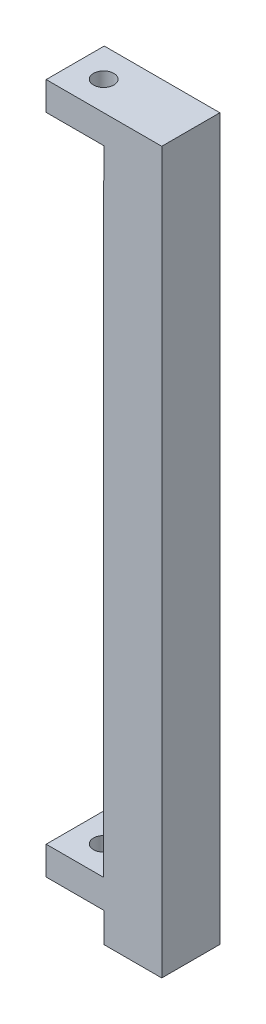
ISO-10303-21;
HEADER;
FILE_DESCRIPTION(('STEP AP214'),'2;1');
FILE_NAME('part.step','',(''),(''),'','','');
FILE_SCHEMA(('AUTOMOTIVE_DESIGN { 1 0 10303 214 1 1 1 1 }'));
ENDSEC;
DATA;
#1=APPLICATION_CONTEXT('core data for automotive mechanical design processes');
#2=APPLICATION_PROTOCOL_DEFINITION('international standard','automotive_design',2000,#1);
#3=PRODUCT_CONTEXT('',#1,'mechanical');
#4=PRODUCT('Part','Part','',(#3));
#5=PRODUCT_RELATED_PRODUCT_CATEGORY('part','',(#4));
#6=PRODUCT_DEFINITION_FORMATION('','',#4);
#7=PRODUCT_DEFINITION_CONTEXT('part definition',#1,'design');
#8=PRODUCT_DEFINITION('design','',#6,#7);
#9=PRODUCT_DEFINITION_SHAPE('','',#8);
#10=(LENGTH_UNIT() NAMED_UNIT(*) SI_UNIT(.MILLI.,.METRE.));
#11=(NAMED_UNIT(*) PLANE_ANGLE_UNIT() SI_UNIT($,.RADIAN.));
#12=(NAMED_UNIT(*) SI_UNIT($,.STERADIAN.) SOLID_ANGLE_UNIT());
#13=UNCERTAINTY_MEASURE_WITH_UNIT(LENGTH_MEASURE(1.E-05),#10,'distance_accuracy_value','');
#14=(GEOMETRIC_REPRESENTATION_CONTEXT(3) GLOBAL_UNCERTAINTY_ASSIGNED_CONTEXT((#13)) GLOBAL_UNIT_ASSIGNED_CONTEXT((#10,
#11,#12)) REPRESENTATION_CONTEXT('',''));
#15=CARTESIAN_POINT('',(0.,0.,0.));
#16=DIRECTION('',(0.,0.,1.));
#17=DIRECTION('',(1.,0.,0.));
#18=AXIS2_PLACEMENT_3D('',#15,#16,#17);
#19=CARTESIAN_POINT('',(10.,0.,-10.));
#20=DIRECTION('',(0.,-1.,0.));
#21=DIRECTION('',(0.,0.,-1.));
#22=AXIS2_PLACEMENT_3D('',#19,#20,#21);
#23=PLANE('',#22);
#24=DIRECTION('',(0.,0.,1.));
#25=VECTOR('',#24,1.);
#26=CARTESIAN_POINT('',(0.1,0.,-10.));
#27=LINE('',#26,#25);
#28=CARTESIAN_POINT('',(0.1,0.,-10.));
#29=VERTEX_POINT('',#28);
#30=CARTESIAN_POINT('',(0.0999999999999994,0.,0.));
#31=VERTEX_POINT('',#30);
#32=EDGE_CURVE('E64',#29,#31,#27,.T.);
#33=ORIENTED_EDGE('',*,*,#32,.F.);
#34=DIRECTION('',(1.,0.,0.));
#35=VECTOR('',#34,1.);
#36=CARTESIAN_POINT('',(10.,0.,-10.));
#37=LINE('',#36,#35);
#38=CARTESIAN_POINT('',(10.,0.,-10.));
#39=VERTEX_POINT('',#38);
#40=EDGE_CURVE('E144',#29,#39,#37,.T.);
#41=ORIENTED_EDGE('',*,*,#40,.T.);
#42=DIRECTION('',(0.,0.,1.));
#43=VECTOR('',#42,1.);
#44=CARTESIAN_POINT('',(10.,0.,-10.));
#45=LINE('',#44,#43);
#46=CARTESIAN_POINT('',(10.,0.,0.));
#47=VERTEX_POINT('',#46);
#48=EDGE_CURVE('E42',#39,#47,#45,.T.);
#49=ORIENTED_EDGE('',*,*,#48,.T.);
#50=DIRECTION('',(1.,0.,0.));
#51=VECTOR('',#50,1.);
#52=CARTESIAN_POINT('',(10.,0.,0.));
#53=LINE('',#52,#51);
#54=EDGE_CURVE('E146',#31,#47,#53,.T.);
#55=ORIENTED_EDGE('',*,*,#54,.F.);
#56=EDGE_LOOP('',(#33,#41,#49,#55));
#57=FACE_BOUND('',#56,.T.);
#58=ADVANCED_FACE('F39',(#57),#23,.T.);
#59=CARTESIAN_POINT('',(-10.,10.,-10.));
#60=DIRECTION('',(0.,1.,0.));
#61=DIRECTION('',(0.,0.,1.));
#62=AXIS2_PLACEMENT_3D('',#59,#60,#61);
#63=PLANE('',#62);
#64=CARTESIAN_POINT('',(-5.,9.99999999999999,-5.));
#65=DIRECTION('',(0.,1.,0.));
#66=DIRECTION('',(0.,0.,1.));
#67=AXIS2_PLACEMENT_3D('',#64,#65,#66);
#68=CIRCLE('',#67,1.75);
#69=CARTESIAN_POINT('',(-5.,9.99999999999999,-3.25));
#70=VERTEX_POINT('',#69);
#71=EDGE_CURVE('E248',#70,#70,#68,.T.);
#72=ORIENTED_EDGE('',*,*,#71,.F.);
#73=EDGE_LOOP('',(#72));
#74=FACE_BOUND('',#73,.T.);
#75=DIRECTION('',(0.,0.,1.));
#76=VECTOR('',#75,1.);
#77=CARTESIAN_POINT('',(-9.9,10.,-10.));
#78=LINE('',#77,#76);
#79=CARTESIAN_POINT('',(-9.9,10.,-10.));
#80=VERTEX_POINT('',#79);
#81=CARTESIAN_POINT('',(-9.9,10.,0.));
#82=VERTEX_POINT('',#81);
#83=EDGE_CURVE('E182',#80,#82,#78,.T.);
#84=ORIENTED_EDGE('',*,*,#83,.T.);
#85=DIRECTION('',(-1.,0.,0.));
#86=VECTOR('',#85,1.);
#87=CARTESIAN_POINT('',(-10.,10.,0.));
#88=LINE('',#87,#86);
#89=CARTESIAN_POINT('',(0.,10.,0.));
#90=VERTEX_POINT('',#89);
#91=EDGE_CURVE('E157',#90,#82,#88,.T.);
#92=ORIENTED_EDGE('',*,*,#91,.F.);
#93=DIRECTION('',(0.,0.,1.));
#94=VECTOR('',#93,1.);
#95=CARTESIAN_POINT('',(0.,10.,-10.));
#96=LINE('',#95,#94);
#97=CARTESIAN_POINT('',(0.,10.,-10.));
#98=VERTEX_POINT('',#97);
#99=EDGE_CURVE('E11',#98,#90,#96,.T.);
#100=ORIENTED_EDGE('',*,*,#99,.F.);
#101=DIRECTION('',(-1.,0.,0.));
#102=VECTOR('',#101,1.);
#103=CARTESIAN_POINT('',(-10.,10.,-10.));
#104=LINE('',#103,#102);
#105=EDGE_CURVE('E175',#98,#80,#104,.T.);
#106=ORIENTED_EDGE('',*,*,#105,.T.);
#107=EDGE_LOOP('',(#84,#92,#100,#106));
#108=FACE_BOUND('',#107,.T.);
#109=ADVANCED_FACE('F292',(#74,#108),#63,.T.);
#110=CARTESIAN_POINT('',(0.,10.,-10.));
#111=DIRECTION('',(-1.,0.,0.));
#112=DIRECTION('',(0.,0.,1.));
#113=AXIS2_PLACEMENT_3D('',#110,#111,#112);
#114=PLANE('',#113);
#115=DIRECTION('',(0.,0.,1.));
#116=VECTOR('',#115,1.);
#117=CARTESIAN_POINT('',(0.,113.9,-10.));
#118=LINE('',#117,#116);
#119=CARTESIAN_POINT('',(0.,113.9,-10.));
#120=VERTEX_POINT('',#119);
#121=CARTESIAN_POINT('',(0.,113.9,0.));
#122=VERTEX_POINT('',#121);
#123=EDGE_CURVE('E56',#120,#122,#118,.T.);
#124=ORIENTED_EDGE('',*,*,#123,.F.);
#125=DIRECTION('',(0.,-1.,0.));
#126=VECTOR('',#125,1.);
#127=CARTESIAN_POINT('',(0.,10.,-10.));
#128=LINE('',#127,#126);
#129=EDGE_CURVE('E172',#120,#98,#128,.T.);
#130=ORIENTED_EDGE('',*,*,#129,.T.);
#131=ORIENTED_EDGE('',*,*,#99,.T.);
#132=DIRECTION('',(0.,-1.,0.));
#133=VECTOR('',#132,1.);
#134=CARTESIAN_POINT('',(0.,10.,0.));
#135=LINE('',#134,#133);
#136=EDGE_CURVE('E164',#122,#90,#135,.T.);
#137=ORIENTED_EDGE('',*,*,#136,.F.);
#138=EDGE_LOOP('',(#124,#130,#131,#137));
#139=FACE_BOUND('',#138,.T.);
#140=ADVANCED_FACE('F296',(#139),#114,.T.);
#141=CARTESIAN_POINT('',(-10.,124.,-10.));
#142=DIRECTION('',(0.,1.,0.));
#143=DIRECTION('',(0.,0.,1.));
#144=AXIS2_PLACEMENT_3D('',#141,#142,#143);
#145=PLANE('',#144);
#146=CARTESIAN_POINT('',(-5.,124.,-5.));
#147=DIRECTION('',(0.,-1.,0.));
#148=DIRECTION('',(0.,0.,-1.));
#149=AXIS2_PLACEMENT_3D('',#146,#147,#148);
#150=CIRCLE('',#149,1.75);
#151=CARTESIAN_POINT('',(-5.,124.,-6.75));
#152=VERTEX_POINT('',#151);
#153=EDGE_CURVE('E274',#152,#152,#150,.T.);
#154=ORIENTED_EDGE('',*,*,#153,.T.);
#155=EDGE_LOOP('',(#154));
#156=FACE_BOUND('',#155,.T.);
#157=DIRECTION('',(0.,0.,1.));
#158=VECTOR('',#157,1.);
#159=CARTESIAN_POINT('',(-9.90000000000001,124.,-10.));
#160=LINE('',#159,#158);
#161=CARTESIAN_POINT('',(-9.90000000000001,124.,-10.));
#162=VERTEX_POINT('',#161);
#163=CARTESIAN_POINT('',(-9.90000000000001,124.,0.));
#164=VERTEX_POINT('',#163);
#165=EDGE_CURVE('E206',#162,#164,#160,.T.);
#166=ORIENTED_EDGE('',*,*,#165,.T.);
#167=DIRECTION('',(-1.,0.,0.));
#168=VECTOR('',#167,1.);
#169=CARTESIAN_POINT('',(-10.,124.,0.));
#170=LINE('',#169,#168);
#171=CARTESIAN_POINT('',(9.99999999999999,124.,0.));
#172=VERTEX_POINT('',#171);
#173=EDGE_CURVE('E186',#172,#164,#170,.T.);
#174=ORIENTED_EDGE('',*,*,#173,.F.);
#175=DIRECTION('',(0.,0.,1.));
#176=VECTOR('',#175,1.);
#177=CARTESIAN_POINT('',(9.99999999999999,124.,-10.));
#178=LINE('',#177,#176);
#179=CARTESIAN_POINT('',(9.99999999999999,124.,-10.));
#180=VERTEX_POINT('',#179);
#181=EDGE_CURVE('E48',#180,#172,#178,.T.);
#182=ORIENTED_EDGE('',*,*,#181,.F.);
#183=DIRECTION('',(-1.,0.,0.));
#184=VECTOR('',#183,1.);
#185=CARTESIAN_POINT('',(-10.,124.,-10.));
#186=LINE('',#185,#184);
#187=EDGE_CURVE('E161',#180,#162,#186,.T.);
#188=ORIENTED_EDGE('',*,*,#187,.T.);
#189=EDGE_LOOP('',(#166,#174,#182,#188));
#190=FACE_BOUND('',#189,.T.);
#191=ADVANCED_FACE('F307',(#156,#190),#145,.T.);
#192=CARTESIAN_POINT('',(9.99999999999999,124.,-10.));
#193=DIRECTION('',(1.,0.,0.));
#194=DIRECTION('',(0.,1.,0.));
#195=AXIS2_PLACEMENT_3D('',#192,#193,#194);
#196=PLANE('',#195);
#197=DIRECTION('',(0.,1.,0.));
#198=VECTOR('',#197,1.);
#199=CARTESIAN_POINT('',(9.99999999999999,124.,0.));
#200=LINE('',#199,#198);
#201=EDGE_CURVE('E181',#47,#172,#200,.T.);
#202=ORIENTED_EDGE('',*,*,#201,.F.);
#203=ORIENTED_EDGE('',*,*,#48,.F.);
#204=DIRECTION('',(0.,1.,0.));
#205=VECTOR('',#204,1.);
#206=CARTESIAN_POINT('',(9.99999999999999,124.,-10.));
#207=LINE('',#206,#205);
#208=EDGE_CURVE('E155',#39,#180,#207,.T.);
#209=ORIENTED_EDGE('',*,*,#208,.T.);
#210=ORIENTED_EDGE('',*,*,#181,.T.);
#211=EDGE_LOOP('',(#202,#203,#209,#210));
#212=FACE_BOUND('',#211,.T.);
#213=ADVANCED_FACE('F196',(#212),#196,.T.);
#214=CARTESIAN_POINT('',(0.,0.,-10.));
#215=DIRECTION('',(0.,0.,-1.));
#216=DIRECTION('',(-1.,0.,0.));
#217=AXIS2_PLACEMENT_3D('',#214,#215,#216);
#218=PLANE('',#217);
#219=DIRECTION('',(0.,1.,0.));
#220=VECTOR('',#219,1.);
#221=CARTESIAN_POINT('',(-9.9,10.,-10.));
#222=LINE('',#221,#220);
#223=CARTESIAN_POINT('',(-9.9,5.1,-10.));
#224=VERTEX_POINT('',#223);
#225=EDGE_CURVE('E148',#224,#80,#222,.T.);
#226=ORIENTED_EDGE('',*,*,#225,.T.);
#227=ORIENTED_EDGE('',*,*,#105,.F.);
#228=ORIENTED_EDGE('',*,*,#129,.F.);
#229=DIRECTION('',(1.,0.,0.));
#230=VECTOR('',#229,1.);
#231=CARTESIAN_POINT('',(0.,113.9,-10.));
#232=LINE('',#231,#230);
#233=CARTESIAN_POINT('',(0.1,113.9,-10.));
#234=VERTEX_POINT('',#233);
#235=EDGE_CURVE('E227',#120,#234,#232,.T.);
#236=ORIENTED_EDGE('',*,*,#235,.T.);
#237=DIRECTION('',(0.,1.,0.));
#238=VECTOR('',#237,1.);
#239=CARTESIAN_POINT('',(0.0999999999999994,119.1,-10.));
#240=LINE('',#239,#238);
#241=CARTESIAN_POINT('',(0.0999999999999994,119.1,-10.));
#242=VERTEX_POINT('',#241);
#243=EDGE_CURVE('E231',#234,#242,#240,.T.);
#244=ORIENTED_EDGE('',*,*,#243,.T.);
#245=DIRECTION('',(-1.,0.,0.));
#246=VECTOR('',#245,1.);
#247=CARTESIAN_POINT('',(-9.90000000000001,119.1,-10.));
#248=LINE('',#247,#246);
#249=CARTESIAN_POINT('',(-9.90000000000001,119.1,-10.));
#250=VERTEX_POINT('',#249);
#251=EDGE_CURVE('E236',#242,#250,#248,.T.);
#252=ORIENTED_EDGE('',*,*,#251,.T.);
#253=DIRECTION('',(0.,1.,0.));
#254=VECTOR('',#253,1.);
#255=CARTESIAN_POINT('',(-9.90000000000001,124.,-10.));
#256=LINE('',#255,#254);
#257=EDGE_CURVE('E240',#250,#162,#256,.T.);
#258=ORIENTED_EDGE('',*,*,#257,.T.);
#259=ORIENTED_EDGE('',*,*,#187,.F.);
#260=ORIENTED_EDGE('',*,*,#208,.F.);
#261=ORIENTED_EDGE('',*,*,#40,.F.);
#262=DIRECTION('',(0.,1.,0.));
#263=VECTOR('',#262,1.);
#264=CARTESIAN_POINT('',(0.1,5.1,-10.));
#265=LINE('',#264,#263);
#266=CARTESIAN_POINT('',(0.1,5.1,-10.));
#267=VERTEX_POINT('',#266);
#268=EDGE_CURVE('E130',#29,#267,#265,.T.);
#269=ORIENTED_EDGE('',*,*,#268,.T.);
#270=DIRECTION('',(-1.,0.,0.));
#271=VECTOR('',#270,1.);
#272=CARTESIAN_POINT('',(-9.9,5.1,-10.));
#273=LINE('',#272,#271);
#274=EDGE_CURVE('E138',#267,#224,#273,.T.);
#275=ORIENTED_EDGE('',*,*,#274,.T.);
#276=EDGE_LOOP('',(#226,#227,#228,#236,#244,#252,#258,#259,#260,#261,#269,#275));
#277=FACE_BOUND('',#276,.T.);
#278=ADVANCED_FACE('F152',(#277),#218,.T.);
#279=CARTESIAN_POINT('',(0.,0.,0.));
#280=DIRECTION('',(0.,0.,-1.));
#281=DIRECTION('',(-1.,0.,0.));
#282=AXIS2_PLACEMENT_3D('',#279,#280,#281);
#283=PLANE('',#282);
#284=ORIENTED_EDGE('',*,*,#91,.T.);
#285=DIRECTION('',(0.,1.,0.));
#286=VECTOR('',#285,1.);
#287=CARTESIAN_POINT('',(-9.9,10.,0.));
#288=LINE('',#287,#286);
#289=CARTESIAN_POINT('',(-9.9,5.1,0.));
#290=VERTEX_POINT('',#289);
#291=EDGE_CURVE('E139',#290,#82,#288,.T.);
#292=ORIENTED_EDGE('',*,*,#291,.F.);
#293=DIRECTION('',(-1.,0.,0.));
#294=VECTOR('',#293,1.);
#295=CARTESIAN_POINT('',(-9.9,5.1,0.));
#296=LINE('',#295,#294);
#297=CARTESIAN_POINT('',(0.1,5.1,0.));
#298=VERTEX_POINT('',#297);
#299=EDGE_CURVE('E204',#298,#290,#296,.T.);
#300=ORIENTED_EDGE('',*,*,#299,.F.);
#301=DIRECTION('',(0.,1.,0.));
#302=VECTOR('',#301,1.);
#303=CARTESIAN_POINT('',(0.1,5.1,0.));
#304=LINE('',#303,#302);
#305=EDGE_CURVE('E201',#31,#298,#304,.T.);
#306=ORIENTED_EDGE('',*,*,#305,.F.);
#307=ORIENTED_EDGE('',*,*,#54,.T.);
#308=ORIENTED_EDGE('',*,*,#201,.T.);
#309=ORIENTED_EDGE('',*,*,#173,.T.);
#310=DIRECTION('',(0.,1.,0.));
#311=VECTOR('',#310,1.);
#312=CARTESIAN_POINT('',(-9.90000000000001,124.,0.));
#313=LINE('',#312,#311);
#314=CARTESIAN_POINT('',(-9.90000000000001,119.1,0.));
#315=VERTEX_POINT('',#314);
#316=EDGE_CURVE('E232',#315,#164,#313,.T.);
#317=ORIENTED_EDGE('',*,*,#316,.F.);
#318=DIRECTION('',(-1.,0.,0.));
#319=VECTOR('',#318,1.);
#320=CARTESIAN_POINT('',(-9.90000000000001,119.1,0.));
#321=LINE('',#320,#319);
#322=CARTESIAN_POINT('',(0.0999999999999994,119.1,0.));
#323=VERTEX_POINT('',#322);
#324=EDGE_CURVE('E252',#323,#315,#321,.T.);
#325=ORIENTED_EDGE('',*,*,#324,.F.);
#326=DIRECTION('',(0.,1.,0.));
#327=VECTOR('',#326,1.);
#328=CARTESIAN_POINT('',(0.0999999999999994,119.1,0.));
#329=LINE('',#328,#327);
#330=CARTESIAN_POINT('',(0.1,113.9,0.));
#331=VERTEX_POINT('',#330);
#332=EDGE_CURVE('E247',#331,#323,#329,.T.);
#333=ORIENTED_EDGE('',*,*,#332,.F.);
#334=DIRECTION('',(1.,0.,0.));
#335=VECTOR('',#334,1.);
#336=CARTESIAN_POINT('',(0.,113.9,0.));
#337=LINE('',#336,#335);
#338=EDGE_CURVE('E244',#122,#331,#337,.T.);
#339=ORIENTED_EDGE('',*,*,#338,.F.);
#340=ORIENTED_EDGE('',*,*,#136,.T.);
#341=EDGE_LOOP('',(#284,#292,#300,#306,#307,#308,#309,#317,#325,#333,#339,#340));
#342=FACE_BOUND('',#341,.T.);
#343=ADVANCED_FACE('F198',(#342),#283,.F.);
#344=CARTESIAN_POINT('',(-9.90000000000001,124.,-10.));
#345=DIRECTION('',(1.,0.,0.));
#346=DIRECTION('',(0.,0.,-1.));
#347=AXIS2_PLACEMENT_3D('',#344,#345,#346);
#348=PLANE('',#347);
#349=ORIENTED_EDGE('',*,*,#316,.T.);
#350=ORIENTED_EDGE('',*,*,#165,.F.);
#351=ORIENTED_EDGE('',*,*,#257,.F.);
#352=DIRECTION('',(0.,0.,1.));
#353=VECTOR('',#352,1.);
#354=CARTESIAN_POINT('',(-9.90000000000001,119.1,-10.));
#355=LINE('',#354,#353);
#356=EDGE_CURVE('E212',#250,#315,#355,.T.);
#357=ORIENTED_EDGE('',*,*,#356,.T.);
#358=EDGE_LOOP('',(#349,#350,#351,#357));
#359=FACE_BOUND('',#358,.T.);
#360=ADVANCED_FACE('F308',(#359),#348,.F.);
#361=CARTESIAN_POINT('',(-9.90000000000001,119.1,-10.));
#362=DIRECTION('',(0.,1.,0.));
#363=DIRECTION('',(0.,0.,1.));
#364=AXIS2_PLACEMENT_3D('',#361,#362,#363);
#365=PLANE('',#364);
#366=CARTESIAN_POINT('',(-5.,119.1,-5.));
#367=DIRECTION('',(0.,1.,0.));
#368=DIRECTION('',(0.,0.,1.));
#369=AXIS2_PLACEMENT_3D('',#366,#367,#368);
#370=CIRCLE('',#369,1.75);
#371=CARTESIAN_POINT('',(-5.,119.1,-3.25));
#372=VERTEX_POINT('',#371);
#373=EDGE_CURVE('E270',#372,#372,#370,.T.);
#374=ORIENTED_EDGE('',*,*,#373,.T.);
#375=EDGE_LOOP('',(#374));
#376=FACE_BOUND('',#375,.T.);
#377=ORIENTED_EDGE('',*,*,#324,.T.);
#378=ORIENTED_EDGE('',*,*,#356,.F.);
#379=ORIENTED_EDGE('',*,*,#251,.F.);
#380=DIRECTION('',(0.,0.,1.));
#381=VECTOR('',#380,1.);
#382=CARTESIAN_POINT('',(0.0999999999999994,119.1,-10.));
#383=LINE('',#382,#381);
#384=EDGE_CURVE('E260',#242,#323,#383,.T.);
#385=ORIENTED_EDGE('',*,*,#384,.T.);
#386=EDGE_LOOP('',(#377,#378,#379,#385));
#387=FACE_BOUND('',#386,.T.);
#388=ADVANCED_FACE('F303',(#376,#387),#365,.F.);
#389=CARTESIAN_POINT('',(0.0999999999999994,119.1,-10.));
#390=DIRECTION('',(1.,0.,0.));
#391=DIRECTION('',(0.,1.,0.));
#392=AXIS2_PLACEMENT_3D('',#389,#390,#391);
#393=PLANE('',#392);
#394=ORIENTED_EDGE('',*,*,#332,.T.);
#395=ORIENTED_EDGE('',*,*,#384,.F.);
#396=ORIENTED_EDGE('',*,*,#243,.F.);
#397=DIRECTION('',(0.,0.,1.));
#398=VECTOR('',#397,1.);
#399=CARTESIAN_POINT('',(0.1,113.9,-10.));
#400=LINE('',#399,#398);
#401=EDGE_CURVE('E262',#234,#331,#400,.T.);
#402=ORIENTED_EDGE('',*,*,#401,.T.);
#403=EDGE_LOOP('',(#394,#395,#396,#402));
#404=FACE_BOUND('',#403,.T.);
#405=ADVANCED_FACE('F299',(#404),#393,.F.);
#406=CARTESIAN_POINT('',(0.,113.9,-10.));
#407=DIRECTION('',(0.,-1.,0.));
#408=DIRECTION('',(0.,0.,-1.));
#409=AXIS2_PLACEMENT_3D('',#406,#407,#408);
#410=PLANE('',#409);
#411=ORIENTED_EDGE('',*,*,#338,.T.);
#412=ORIENTED_EDGE('',*,*,#401,.F.);
#413=ORIENTED_EDGE('',*,*,#235,.F.);
#414=ORIENTED_EDGE('',*,*,#123,.T.);
#415=EDGE_LOOP('',(#411,#412,#413,#414));
#416=FACE_BOUND('',#415,.T.);
#417=ADVANCED_FACE('F297',(#416),#410,.F.);
#418=CARTESIAN_POINT('',(-9.9,10.,-10.));
#419=DIRECTION('',(1.,0.,0.));
#420=DIRECTION('',(0.,0.,-1.));
#421=AXIS2_PLACEMENT_3D('',#418,#419,#420);
#422=PLANE('',#421);
#423=ORIENTED_EDGE('',*,*,#291,.T.);
#424=ORIENTED_EDGE('',*,*,#83,.F.);
#425=ORIENTED_EDGE('',*,*,#225,.F.);
#426=DIRECTION('',(0.,0.,1.));
#427=VECTOR('',#426,1.);
#428=CARTESIAN_POINT('',(-9.9,5.1,-10.));
#429=LINE('',#428,#427);
#430=EDGE_CURVE('E222',#224,#290,#429,.T.);
#431=ORIENTED_EDGE('',*,*,#430,.T.);
#432=EDGE_LOOP('',(#423,#424,#425,#431));
#433=FACE_BOUND('',#432,.T.);
#434=ADVANCED_FACE('F309',(#433),#422,.F.);
#435=CARTESIAN_POINT('',(-9.9,5.1,-10.));
#436=DIRECTION('',(0.,1.,0.));
#437=DIRECTION('',(0.,0.,1.));
#438=AXIS2_PLACEMENT_3D('',#435,#436,#437);
#439=PLANE('',#438);
#440=CARTESIAN_POINT('',(-5.,5.1,-5.));
#441=DIRECTION('',(0.,-1.,0.));
#442=DIRECTION('',(0.,0.,-1.));
#443=AXIS2_PLACEMENT_3D('',#440,#441,#442);
#444=CIRCLE('',#443,1.75);
#445=CARTESIAN_POINT('',(-5.,5.1,-6.75));
#446=VERTEX_POINT('',#445);
#447=EDGE_CURVE('E278',#446,#446,#444,.T.);
#448=ORIENTED_EDGE('',*,*,#447,.F.);
#449=EDGE_LOOP('',(#448));
#450=FACE_BOUND('',#449,.T.);
#451=ORIENTED_EDGE('',*,*,#299,.T.);
#452=ORIENTED_EDGE('',*,*,#430,.F.);
#453=ORIENTED_EDGE('',*,*,#274,.F.);
#454=DIRECTION('',(0.,0.,1.));
#455=VECTOR('',#454,1.);
#456=CARTESIAN_POINT('',(0.1,5.1,-10.));
#457=LINE('',#456,#455);
#458=EDGE_CURVE('E132',#267,#298,#457,.T.);
#459=ORIENTED_EDGE('',*,*,#458,.T.);
#460=EDGE_LOOP('',(#451,#452,#453,#459));
#461=FACE_BOUND('',#460,.T.);
#462=ADVANCED_FACE('F311',(#450,#461),#439,.F.);
#463=CARTESIAN_POINT('',(0.1,5.1,-10.));
#464=DIRECTION('',(1.,0.,0.));
#465=DIRECTION('',(0.,0.,-1.));
#466=AXIS2_PLACEMENT_3D('',#463,#464,#465);
#467=PLANE('',#466);
#468=ORIENTED_EDGE('',*,*,#305,.T.);
#469=ORIENTED_EDGE('',*,*,#458,.F.);
#470=ORIENTED_EDGE('',*,*,#268,.F.);
#471=ORIENTED_EDGE('',*,*,#32,.T.);
#472=EDGE_LOOP('',(#468,#469,#470,#471));
#473=FACE_BOUND('',#472,.T.);
#474=ADVANCED_FACE('F131',(#473),#467,.F.);
#475=CARTESIAN_POINT('',(-5.,124.,-5.));
#476=DIRECTION('',(0.,-1.,0.));
#477=DIRECTION('',(0.,0.,-1.));
#478=AXIS2_PLACEMENT_3D('',#475,#476,#477);
#479=CYLINDRICAL_SURFACE('',#478,1.75);
#480=ORIENTED_EDGE('',*,*,#71,.T.);
#481=EDGE_LOOP('',(#480));
#482=FACE_BOUND('',#481,.T.);
#483=ORIENTED_EDGE('',*,*,#447,.T.);
#484=EDGE_LOOP('',(#483));
#485=FACE_BOUND('',#484,.T.);
#486=ADVANCED_FACE('F319',(#482,#485),#479,.F.);
#487=ORIENTED_EDGE('',*,*,#153,.F.);
#488=EDGE_LOOP('',(#487));
#489=FACE_BOUND('',#488,.T.);
#490=ORIENTED_EDGE('',*,*,#373,.F.);
#491=EDGE_LOOP('',(#490));
#492=FACE_BOUND('',#491,.T.);
#493=ADVANCED_FACE('F430',(#489,#492),#479,.F.);
#494=CLOSED_SHELL('',(#58,#109,#140,#191,#213,#278,#343,#360,#388,#405,#417,#434,#462,#474,#486,#493));
#495=MANIFOLD_SOLID_BREP('B2',#494);
#496=ADVANCED_BREP_SHAPE_REPRESENTATION('',(#18,#495),#14);
#497=SHAPE_DEFINITION_REPRESENTATION(#9,#496);
ENDSEC;
END-ISO-10303-21;
